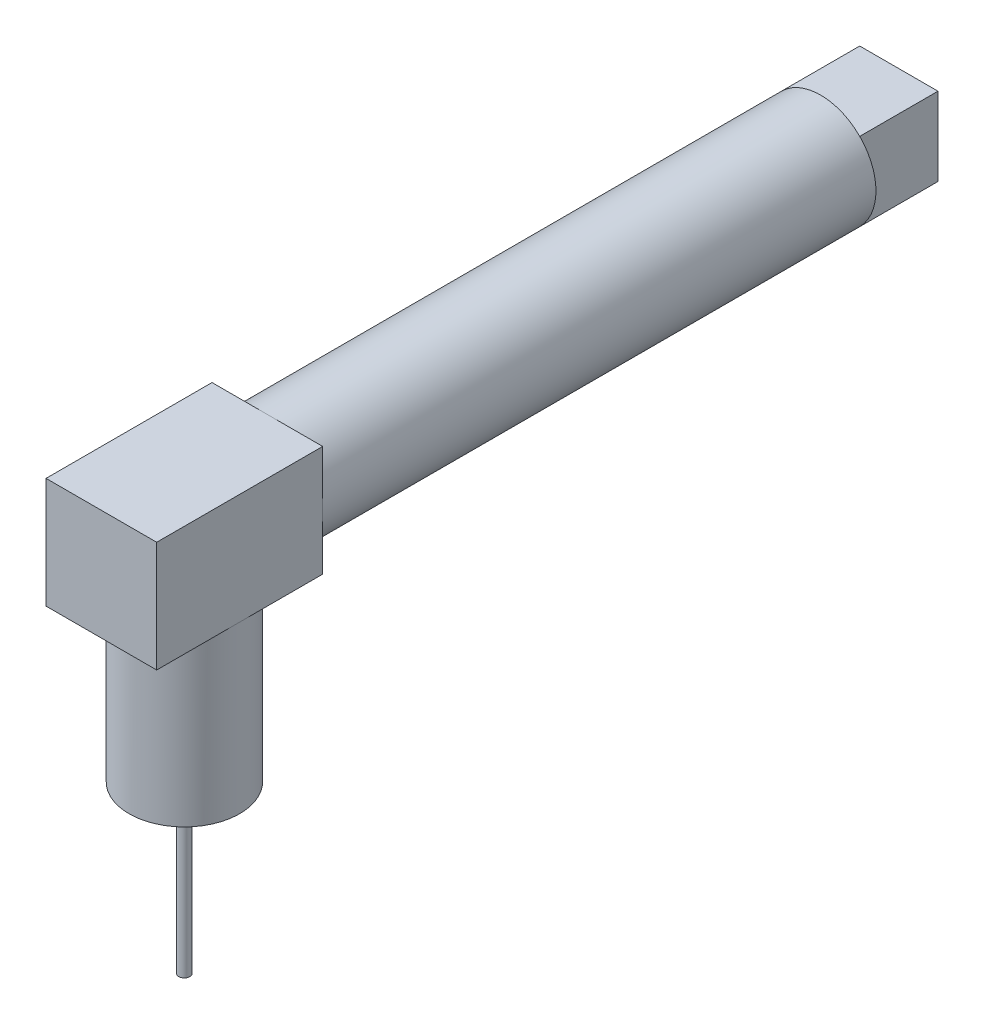
ISO-10303-21;
HEADER;
FILE_DESCRIPTION(('STEP AP214'),'2;1');
FILE_NAME('part.step','',(''),(''),'','','');
FILE_SCHEMA(('AUTOMOTIVE_DESIGN { 1 0 10303 214 1 1 1 1 }'));
ENDSEC;
DATA;
#1=APPLICATION_CONTEXT('core data for automotive mechanical design processes');
#2=APPLICATION_PROTOCOL_DEFINITION('international standard','automotive_design',2000,#1);
#3=PRODUCT_CONTEXT('',#1,'mechanical');
#4=PRODUCT('Part','Part','',(#3));
#5=PRODUCT_RELATED_PRODUCT_CATEGORY('part','',(#4));
#6=PRODUCT_DEFINITION_FORMATION('','',#4);
#7=PRODUCT_DEFINITION_CONTEXT('part definition',#1,'design');
#8=PRODUCT_DEFINITION('design','',#6,#7);
#9=PRODUCT_DEFINITION_SHAPE('','',#8);
#10=(LENGTH_UNIT() NAMED_UNIT(*) SI_UNIT(.MILLI.,.METRE.));
#11=(NAMED_UNIT(*) PLANE_ANGLE_UNIT() SI_UNIT($,.RADIAN.));
#12=(NAMED_UNIT(*) SI_UNIT($,.STERADIAN.) SOLID_ANGLE_UNIT());
#13=UNCERTAINTY_MEASURE_WITH_UNIT(LENGTH_MEASURE(1.E-05),#10,'distance_accuracy_value','');
#14=(GEOMETRIC_REPRESENTATION_CONTEXT(3) GLOBAL_UNCERTAINTY_ASSIGNED_CONTEXT((#13)) GLOBAL_UNIT_ASSIGNED_CONTEXT((#10,
#11,#12)) REPRESENTATION_CONTEXT('',''));
#15=CARTESIAN_POINT('',(0.,0.,0.));
#16=DIRECTION('',(0.,0.,1.));
#17=DIRECTION('',(1.,0.,0.));
#18=AXIS2_PLACEMENT_3D('',#15,#16,#17);
#19=CARTESIAN_POINT('',(0.,0.,0.));
#20=DIRECTION('',(0.,0.,1.));
#21=DIRECTION('',(1.,0.,0.));
#22=AXIS2_PLACEMENT_3D('',#19,#20,#21);
#23=PLANE('',#22);
#24=DIRECTION('',(0.,1.,0.));
#25=VECTOR('',#24,1.);
#26=CARTESIAN_POINT('',(-3.53553390593274,-3.53553390593274,0.));
#27=LINE('',#26,#25);
#28=CARTESIAN_POINT('',(-3.53553390593274,-3.53553390593274,0.));
#29=VERTEX_POINT('',#28);
#30=CARTESIAN_POINT('',(-3.53553390593274,3.53553390593274,0.));
#31=VERTEX_POINT('',#30);
#32=EDGE_CURVE('E65',#29,#31,#27,.T.);
#33=ORIENTED_EDGE('',*,*,#32,.F.);
#34=CARTESIAN_POINT('',(0.,0.,0.));
#35=DIRECTION('',(0.,0.,1.));
#36=DIRECTION('',(1.,0.,0.));
#37=AXIS2_PLACEMENT_3D('',#34,#35,#36);
#38=CIRCLE('',#37,5.);
#39=EDGE_CURVE('E233',#31,#29,#38,.T.);
#40=ORIENTED_EDGE('',*,*,#39,.F.);
#41=EDGE_LOOP('',(#33,#40));
#42=FACE_BOUND('',#41,.T.);
#43=ADVANCED_FACE('F43',(#42),#23,.F.);
#44=DIRECTION('',(-1.,0.,0.));
#45=VECTOR('',#44,1.);
#46=CARTESIAN_POINT('',(3.53553390593274,-3.53553390593274,0.));
#47=LINE('',#46,#45);
#48=CARTESIAN_POINT('',(3.53553390593274,-3.53553390593274,0.));
#49=VERTEX_POINT('',#48);
#50=EDGE_CURVE('E58',#49,#29,#47,.T.);
#51=ORIENTED_EDGE('',*,*,#50,.F.);
#52=EDGE_CURVE('E241',#29,#49,#38,.T.);
#53=ORIENTED_EDGE('',*,*,#52,.F.);
#54=EDGE_LOOP('',(#51,#53));
#55=FACE_BOUND('',#54,.T.);
#56=ADVANCED_FACE('F275',(#55),#23,.F.);
#57=DIRECTION('',(0.,-1.,0.));
#58=VECTOR('',#57,1.);
#59=CARTESIAN_POINT('',(3.53553390593274,-3.53553390593274,0.));
#60=LINE('',#59,#58);
#61=CARTESIAN_POINT('',(3.53553390593274,3.53553390593274,0.));
#62=VERTEX_POINT('',#61);
#63=EDGE_CURVE('E249',#62,#49,#60,.T.);
#64=ORIENTED_EDGE('',*,*,#63,.F.);
#65=EDGE_CURVE('E225',#49,#62,#38,.T.);
#66=ORIENTED_EDGE('',*,*,#65,.F.);
#67=EDGE_LOOP('',(#64,#66));
#68=FACE_BOUND('',#67,.T.);
#69=ADVANCED_FACE('F279',(#68),#23,.F.);
#70=DIRECTION('',(1.,0.,0.));
#71=VECTOR('',#70,1.);
#72=CARTESIAN_POINT('',(3.53553390593274,3.53553390593274,0.));
#73=LINE('',#72,#71);
#74=EDGE_CURVE('E254',#31,#62,#73,.T.);
#75=ORIENTED_EDGE('',*,*,#74,.F.);
#76=EDGE_CURVE('E230',#62,#31,#38,.T.);
#77=ORIENTED_EDGE('',*,*,#76,.F.);
#78=EDGE_LOOP('',(#75,#77));
#79=FACE_BOUND('',#78,.T.);
#80=ADVANCED_FACE('F273',(#79),#23,.F.);
#81=CARTESIAN_POINT('',(-5.,-5.,65.));
#82=DIRECTION('',(0.,1.,0.));
#83=DIRECTION('',(0.,0.,1.));
#84=AXIS2_PLACEMENT_3D('',#81,#82,#83);
#85=PLANE('',#84);
#86=CARTESIAN_POINT('',(0.,-5.,57.5));
#87=DIRECTION('',(0.,1.,0.));
#88=DIRECTION('',(0.,0.,1.));
#89=AXIS2_PLACEMENT_3D('',#86,#87,#88);
#90=CIRCLE('',#89,5.);
#91=CARTESIAN_POINT('',(-5.,-5.,57.5));
#92=VERTEX_POINT('',#91);
#93=CARTESIAN_POINT('',(5.,-5.,57.5));
#94=VERTEX_POINT('',#93);
#95=EDGE_CURVE('E11',#92,#94,#90,.F.);
#96=ORIENTED_EDGE('',*,*,#95,.F.);
#97=DIRECTION('',(0.,0.,-1.));
#98=VECTOR('',#97,1.);
#99=CARTESIAN_POINT('',(-5.,-5.,65.));
#100=LINE('',#99,#98);
#101=CARTESIAN_POINT('',(-5.,-5.,50.));
#102=VERTEX_POINT('',#101);
#103=EDGE_CURVE('E213',#92,#102,#100,.T.);
#104=ORIENTED_EDGE('',*,*,#103,.T.);
#105=DIRECTION('',(1.,0.,0.));
#106=VECTOR('',#105,1.);
#107=CARTESIAN_POINT('',(-5.,-5.,50.));
#108=LINE('',#107,#106);
#109=CARTESIAN_POINT('',(0.,-5.,50.));
#110=VERTEX_POINT('',#109);
#111=EDGE_CURVE('E181',#102,#110,#108,.T.);
#112=ORIENTED_EDGE('',*,*,#111,.T.);
#113=CARTESIAN_POINT('',(5.,-5.,50.));
#114=VERTEX_POINT('',#113);
#115=EDGE_CURVE('E205',#110,#114,#108,.T.);
#116=ORIENTED_EDGE('',*,*,#115,.T.);
#117=DIRECTION('',(0.,0.,-1.));
#118=VECTOR('',#117,1.);
#119=CARTESIAN_POINT('',(5.,-5.,65.));
#120=LINE('',#119,#118);
#121=EDGE_CURVE('E190',#94,#114,#120,.T.);
#122=ORIENTED_EDGE('',*,*,#121,.F.);
#123=EDGE_LOOP('',(#96,#104,#112,#116,#122));
#124=FACE_BOUND('',#123,.T.);
#125=ADVANCED_FACE('F282',(#124),#85,.F.);
#126=CARTESIAN_POINT('',(0.,0.,50.));
#127=DIRECTION('',(0.,0.,-1.));
#128=DIRECTION('',(-1.,0.,0.));
#129=AXIS2_PLACEMENT_3D('',#126,#127,#128);
#130=CYLINDRICAL_SURFACE('',#129,5.);
#131=CARTESIAN_POINT('',(0.,0.,50.));
#132=DIRECTION('',(0.,0.,1.));
#133=DIRECTION('',(1.,0.,0.));
#134=AXIS2_PLACEMENT_3D('',#131,#132,#133);
#135=CIRCLE('',#134,5.);
#136=CARTESIAN_POINT('',(5.,0.,50.));
#137=VERTEX_POINT('',#136);
#138=CARTESIAN_POINT('',(0.,5.,50.));
#139=VERTEX_POINT('',#138);
#140=EDGE_CURVE('E52',#137,#139,#135,.T.);
#141=ORIENTED_EDGE('',*,*,#140,.F.);
#142=EDGE_CURVE('E229',#110,#137,#135,.T.);
#143=ORIENTED_EDGE('',*,*,#142,.F.);
#144=CARTESIAN_POINT('',(-5.,0.,50.));
#145=VERTEX_POINT('',#144);
#146=EDGE_CURVE('E240',#145,#110,#135,.T.);
#147=ORIENTED_EDGE('',*,*,#146,.F.);
#148=EDGE_CURVE('E228',#139,#145,#135,.T.);
#149=ORIENTED_EDGE('',*,*,#148,.F.);
#150=EDGE_LOOP('',(#141,#143,#147,#149));
#151=FACE_BOUND('',#150,.T.);
#152=ORIENTED_EDGE('',*,*,#76,.T.);
#153=ORIENTED_EDGE('',*,*,#39,.T.);
#154=ORIENTED_EDGE('',*,*,#52,.T.);
#155=ORIENTED_EDGE('',*,*,#65,.T.);
#156=EDGE_LOOP('',(#152,#153,#154,#155));
#157=FACE_BOUND('',#156,.T.);
#158=ADVANCED_FACE('F45',(#151,#157),#130,.T.);
#159=CARTESIAN_POINT('',(0.,0.,50.));
#160=DIRECTION('',(0.,0.,-1.));
#161=DIRECTION('',(-1.,0.,0.));
#162=AXIS2_PLACEMENT_3D('',#159,#160,#161);
#163=PLANE('',#162);
#164=DIRECTION('',(0.,1.,0.));
#165=VECTOR('',#164,1.);
#166=CARTESIAN_POINT('',(5.,-5.,50.));
#167=LINE('',#166,#165);
#168=CARTESIAN_POINT('',(5.,5.,50.));
#169=VERTEX_POINT('',#168);
#170=EDGE_CURVE('E172',#137,#169,#167,.T.);
#171=ORIENTED_EDGE('',*,*,#170,.F.);
#172=ORIENTED_EDGE('',*,*,#140,.T.);
#173=DIRECTION('',(-1.,0.,0.));
#174=VECTOR('',#173,1.);
#175=CARTESIAN_POINT('',(-5.,5.,50.));
#176=LINE('',#175,#174);
#177=EDGE_CURVE('E196',#169,#139,#176,.T.);
#178=ORIENTED_EDGE('',*,*,#177,.F.);
#179=EDGE_LOOP('',(#171,#172,#178));
#180=FACE_BOUND('',#179,.T.);
#181=ADVANCED_FACE('F406',(#180),#163,.T.);
#182=CARTESIAN_POINT('',(-5.,5.,50.));
#183=VERTEX_POINT('',#182);
#184=EDGE_CURVE('E195',#139,#183,#176,.T.);
#185=ORIENTED_EDGE('',*,*,#184,.F.);
#186=ORIENTED_EDGE('',*,*,#148,.T.);
#187=DIRECTION('',(0.,-1.,0.));
#188=VECTOR('',#187,1.);
#189=CARTESIAN_POINT('',(-5.,-5.,50.));
#190=LINE('',#189,#188);
#191=EDGE_CURVE('E201',#183,#145,#190,.T.);
#192=ORIENTED_EDGE('',*,*,#191,.F.);
#193=EDGE_LOOP('',(#185,#186,#192));
#194=FACE_BOUND('',#193,.T.);
#195=ADVANCED_FACE('F428',(#194),#163,.T.);
#196=EDGE_CURVE('E200',#145,#102,#190,.T.);
#197=ORIENTED_EDGE('',*,*,#196,.F.);
#198=ORIENTED_EDGE('',*,*,#146,.T.);
#199=ORIENTED_EDGE('',*,*,#111,.F.);
#200=EDGE_LOOP('',(#197,#198,#199));
#201=FACE_BOUND('',#200,.T.);
#202=ADVANCED_FACE('F386',(#201),#163,.T.);
#203=CARTESIAN_POINT('',(5.,-5.,65.));
#204=DIRECTION('',(-1.,0.,0.));
#205=DIRECTION('',(0.,0.,1.));
#206=AXIS2_PLACEMENT_3D('',#203,#204,#205);
#207=PLANE('',#206);
#208=EDGE_CURVE('E191',#114,#137,#167,.T.);
#209=ORIENTED_EDGE('',*,*,#208,.T.);
#210=ORIENTED_EDGE('',*,*,#170,.T.);
#211=DIRECTION('',(0.,0.,-1.));
#212=VECTOR('',#211,1.);
#213=CARTESIAN_POINT('',(5.,5.,65.));
#214=LINE('',#213,#212);
#215=CARTESIAN_POINT('',(5.,5.,65.));
#216=VERTEX_POINT('',#215);
#217=EDGE_CURVE('E221',#216,#169,#214,.T.);
#218=ORIENTED_EDGE('',*,*,#217,.F.);
#219=DIRECTION('',(0.,1.,0.));
#220=VECTOR('',#219,1.);
#221=CARTESIAN_POINT('',(5.,-5.,65.));
#222=LINE('',#221,#220);
#223=CARTESIAN_POINT('',(5.,-5.,65.));
#224=VERTEX_POINT('',#223);
#225=EDGE_CURVE('E176',#224,#216,#222,.T.);
#226=ORIENTED_EDGE('',*,*,#225,.F.);
#227=EDGE_CURVE('E209',#224,#94,#120,.T.);
#228=ORIENTED_EDGE('',*,*,#227,.T.);
#229=ORIENTED_EDGE('',*,*,#121,.T.);
#230=EDGE_LOOP('',(#209,#210,#218,#226,#228,#229));
#231=FACE_BOUND('',#230,.T.);
#232=ADVANCED_FACE('F381',(#231),#207,.F.);
#233=CARTESIAN_POINT('',(-5.,5.,65.));
#234=DIRECTION('',(0.,-1.,0.));
#235=DIRECTION('',(0.,0.,-1.));
#236=AXIS2_PLACEMENT_3D('',#233,#234,#235);
#237=PLANE('',#236);
#238=ORIENTED_EDGE('',*,*,#177,.T.);
#239=ORIENTED_EDGE('',*,*,#184,.T.);
#240=DIRECTION('',(0.,0.,-1.));
#241=VECTOR('',#240,1.);
#242=CARTESIAN_POINT('',(-5.,5.,65.));
#243=LINE('',#242,#241);
#244=CARTESIAN_POINT('',(-5.,5.,65.));
#245=VERTEX_POINT('',#244);
#246=EDGE_CURVE('E217',#245,#183,#243,.T.);
#247=ORIENTED_EDGE('',*,*,#246,.F.);
#248=DIRECTION('',(-1.,0.,0.));
#249=VECTOR('',#248,1.);
#250=CARTESIAN_POINT('',(-5.,5.,65.));
#251=LINE('',#250,#249);
#252=EDGE_CURVE('E180',#216,#245,#251,.T.);
#253=ORIENTED_EDGE('',*,*,#252,.F.);
#254=ORIENTED_EDGE('',*,*,#217,.T.);
#255=EDGE_LOOP('',(#238,#239,#247,#253,#254));
#256=FACE_BOUND('',#255,.T.);
#257=ADVANCED_FACE('F372',(#256),#237,.F.);
#258=CARTESIAN_POINT('',(-5.,-5.,65.));
#259=DIRECTION('',(1.,0.,0.));
#260=DIRECTION('',(0.,0.,-1.));
#261=AXIS2_PLACEMENT_3D('',#258,#259,#260);
#262=PLANE('',#261);
#263=ORIENTED_EDGE('',*,*,#191,.T.);
#264=ORIENTED_EDGE('',*,*,#196,.T.);
#265=ORIENTED_EDGE('',*,*,#103,.F.);
#266=CARTESIAN_POINT('',(-5.,-5.,65.));
#267=VERTEX_POINT('',#266);
#268=EDGE_CURVE('E214',#267,#92,#100,.T.);
#269=ORIENTED_EDGE('',*,*,#268,.F.);
#270=DIRECTION('',(0.,-1.,0.));
#271=VECTOR('',#270,1.);
#272=CARTESIAN_POINT('',(-5.,-5.,65.));
#273=LINE('',#272,#271);
#274=EDGE_CURVE('E184',#245,#267,#273,.T.);
#275=ORIENTED_EDGE('',*,*,#274,.F.);
#276=ORIENTED_EDGE('',*,*,#246,.T.);
#277=EDGE_LOOP('',(#263,#264,#265,#269,#275,#276));
#278=FACE_BOUND('',#277,.T.);
#279=ADVANCED_FACE('F360',(#278),#262,.F.);
#280=CARTESIAN_POINT('',(0.,-5.,57.5));
#281=DIRECTION('',(0.,-1.,0.));
#282=DIRECTION('',(0.,0.,-1.));
#283=AXIS2_PLACEMENT_3D('',#280,#281,#282);
#284=CIRCLE('',#283,5.);
#285=EDGE_CURVE('E166',#94,#92,#284,.T.);
#286=ORIENTED_EDGE('',*,*,#285,.F.);
#287=ORIENTED_EDGE('',*,*,#227,.F.);
#288=DIRECTION('',(1.,0.,0.));
#289=VECTOR('',#288,1.);
#290=CARTESIAN_POINT('',(-5.,-5.,65.));
#291=LINE('',#290,#289);
#292=EDGE_CURVE('E187',#267,#224,#291,.T.);
#293=ORIENTED_EDGE('',*,*,#292,.F.);
#294=ORIENTED_EDGE('',*,*,#268,.T.);
#295=EDGE_LOOP('',(#286,#287,#293,#294));
#296=FACE_BOUND('',#295,.T.);
#297=ADVANCED_FACE('F289',(#296),#85,.F.);
#298=CARTESIAN_POINT('',(0.,0.,65.));
#299=DIRECTION('',(0.,0.,-1.));
#300=DIRECTION('',(-1.,0.,0.));
#301=AXIS2_PLACEMENT_3D('',#298,#299,#300);
#302=PLANE('',#301);
#303=ORIENTED_EDGE('',*,*,#225,.T.);
#304=ORIENTED_EDGE('',*,*,#252,.T.);
#305=ORIENTED_EDGE('',*,*,#274,.T.);
#306=ORIENTED_EDGE('',*,*,#292,.T.);
#307=EDGE_LOOP('',(#303,#304,#305,#306));
#308=FACE_BOUND('',#307,.T.);
#309=ADVANCED_FACE('F359',(#308),#302,.F.);
#310=ORIENTED_EDGE('',*,*,#115,.F.);
#311=ORIENTED_EDGE('',*,*,#142,.T.);
#312=ORIENTED_EDGE('',*,*,#208,.F.);
#313=EDGE_LOOP('',(#310,#311,#312));
#314=FACE_BOUND('',#313,.T.);
#315=ADVANCED_FACE('F346',(#314),#163,.T.);
#316=CARTESIAN_POINT('',(0.,-20.,57.5));
#317=DIRECTION('',(0.,1.,0.));
#318=DIRECTION('',(0.,0.,1.));
#319=AXIS2_PLACEMENT_3D('',#316,#317,#318);
#320=CYLINDRICAL_SURFACE('',#319,5.);
#321=CARTESIAN_POINT('',(0.,-20.,57.5));
#322=DIRECTION('',(0.,-1.,0.));
#323=DIRECTION('',(0.,0.,-1.));
#324=AXIS2_PLACEMENT_3D('',#321,#322,#323);
#325=CIRCLE('',#324,5.);
#326=CARTESIAN_POINT('',(0.,-20.,52.5));
#327=VERTEX_POINT('',#326);
#328=EDGE_CURVE('E168',#327,#327,#325,.T.);
#329=ORIENTED_EDGE('',*,*,#328,.F.);
#330=EDGE_LOOP('',(#329));
#331=FACE_BOUND('',#330,.T.);
#332=ORIENTED_EDGE('',*,*,#285,.T.);
#333=ORIENTED_EDGE('',*,*,#95,.T.);
#334=EDGE_LOOP('',(#332,#333));
#335=FACE_BOUND('',#334,.T.);
#336=ADVANCED_FACE('F335',(#331,#335),#320,.T.);
#337=CARTESIAN_POINT('',(0.,-20.,57.5));
#338=DIRECTION('',(0.,-1.,0.));
#339=DIRECTION('',(0.,0.,-1.));
#340=AXIS2_PLACEMENT_3D('',#337,#338,#339);
#341=PLANE('',#340);
#342=CARTESIAN_POINT('',(0.,-20.,57.5));
#343=DIRECTION('',(0.,-1.,0.));
#344=DIRECTION('',(0.,0.,-1.));
#345=AXIS2_PLACEMENT_3D('',#342,#343,#344);
#346=CIRCLE('',#345,0.5);
#347=CARTESIAN_POINT('',(0.,-20.,57.));
#348=VERTEX_POINT('',#347);
#349=EDGE_CURVE('E153',#348,#348,#346,.T.);
#350=ORIENTED_EDGE('',*,*,#349,.F.);
#351=EDGE_LOOP('',(#350));
#352=FACE_BOUND('',#351,.T.);
#353=ORIENTED_EDGE('',*,*,#328,.T.);
#354=EDGE_LOOP('',(#353));
#355=FACE_BOUND('',#354,.T.);
#356=ADVANCED_FACE('F324',(#352,#355),#341,.T.);
#357=CARTESIAN_POINT('',(0.,-35.,57.5));
#358=DIRECTION('',(0.,1.,0.));
#359=DIRECTION('',(0.,0.,1.));
#360=AXIS2_PLACEMENT_3D('',#357,#358,#359);
#361=CYLINDRICAL_SURFACE('',#360,0.5);
#362=CARTESIAN_POINT('',(0.,-35.,57.5));
#363=DIRECTION('',(0.,-1.,0.));
#364=DIRECTION('',(0.,0.,-1.));
#365=AXIS2_PLACEMENT_3D('',#362,#363,#364);
#366=CIRCLE('',#365,0.5);
#367=CARTESIAN_POINT('',(0.,-35.,57.));
#368=VERTEX_POINT('',#367);
#369=EDGE_CURVE('E158',#368,#368,#366,.T.);
#370=ORIENTED_EDGE('',*,*,#369,.F.);
#371=EDGE_LOOP('',(#370));
#372=FACE_BOUND('',#371,.T.);
#373=ORIENTED_EDGE('',*,*,#349,.T.);
#374=EDGE_LOOP('',(#373));
#375=FACE_BOUND('',#374,.T.);
#376=ADVANCED_FACE('F311',(#372,#375),#361,.T.);
#377=CARTESIAN_POINT('',(0.,-35.,57.5));
#378=DIRECTION('',(0.,-1.,0.));
#379=DIRECTION('',(0.,0.,-1.));
#380=AXIS2_PLACEMENT_3D('',#377,#378,#379);
#381=PLANE('',#380);
#382=ORIENTED_EDGE('',*,*,#369,.T.);
#383=EDGE_LOOP('',(#382));
#384=FACE_BOUND('',#383,.T.);
#385=ADVANCED_FACE('F306',(#384),#381,.T.);
#386=CARTESIAN_POINT('',(-3.53553390593274,-3.53553390593274,-7.07));
#387=DIRECTION('',(1.,0.,0.));
#388=DIRECTION('',(0.,0.,-1.));
#389=AXIS2_PLACEMENT_3D('',#386,#387,#388);
#390=PLANE('',#389);
#391=ORIENTED_EDGE('',*,*,#32,.T.);
#392=DIRECTION('',(0.,0.,1.));
#393=VECTOR('',#392,1.);
#394=CARTESIAN_POINT('',(-3.53553390593274,3.53553390593274,-7.07));
#395=LINE('',#394,#393);
#396=CARTESIAN_POINT('',(-3.53553390593274,3.53553390593274,-7.07));
#397=VERTEX_POINT('',#396);
#398=EDGE_CURVE('E133',#397,#31,#395,.T.);
#399=ORIENTED_EDGE('',*,*,#398,.F.);
#400=DIRECTION('',(0.,1.,0.));
#401=VECTOR('',#400,1.);
#402=CARTESIAN_POINT('',(-3.53553390593274,-3.53553390593274,-7.07));
#403=LINE('',#402,#401);
#404=CARTESIAN_POINT('',(-3.53553390593274,-3.53553390593274,-7.07));
#405=VERTEX_POINT('',#404);
#406=EDGE_CURVE('E140',#405,#397,#403,.T.);
#407=ORIENTED_EDGE('',*,*,#406,.F.);
#408=DIRECTION('',(0.,0.,1.));
#409=VECTOR('',#408,1.);
#410=CARTESIAN_POINT('',(-3.53553390593274,-3.53553390593274,-7.07));
#411=LINE('',#410,#409);
#412=EDGE_CURVE('E259',#405,#29,#411,.T.);
#413=ORIENTED_EDGE('',*,*,#412,.T.);
#414=EDGE_LOOP('',(#391,#399,#407,#413));
#415=FACE_BOUND('',#414,.T.);
#416=ADVANCED_FACE('F151',(#415),#390,.F.);
#417=CARTESIAN_POINT('',(3.53553390593274,3.53553390593274,-7.07));
#418=DIRECTION('',(0.,-1.,0.));
#419=DIRECTION('',(0.,0.,-1.));
#420=AXIS2_PLACEMENT_3D('',#417,#418,#419);
#421=PLANE('',#420);
#422=ORIENTED_EDGE('',*,*,#74,.T.);
#423=DIRECTION('',(0.,0.,1.));
#424=VECTOR('',#423,1.);
#425=CARTESIAN_POINT('',(3.53553390593274,3.53553390593274,-7.07));
#426=LINE('',#425,#424);
#427=CARTESIAN_POINT('',(3.53553390593274,3.53553390593274,-7.07));
#428=VERTEX_POINT('',#427);
#429=EDGE_CURVE('E135',#428,#62,#426,.T.);
#430=ORIENTED_EDGE('',*,*,#429,.F.);
#431=DIRECTION('',(1.,0.,0.));
#432=VECTOR('',#431,1.);
#433=CARTESIAN_POINT('',(3.53553390593274,3.53553390593274,-7.07));
#434=LINE('',#433,#432);
#435=EDGE_CURVE('E128',#397,#428,#434,.T.);
#436=ORIENTED_EDGE('',*,*,#435,.F.);
#437=ORIENTED_EDGE('',*,*,#398,.T.);
#438=EDGE_LOOP('',(#422,#430,#436,#437));
#439=FACE_BOUND('',#438,.T.);
#440=ADVANCED_FACE('F131',(#439),#421,.F.);
#441=CARTESIAN_POINT('',(3.53553390593274,-3.53553390593274,-7.07));
#442=DIRECTION('',(-1.,0.,0.));
#443=DIRECTION('',(0.,0.,1.));
#444=AXIS2_PLACEMENT_3D('',#441,#442,#443);
#445=PLANE('',#444);
#446=ORIENTED_EDGE('',*,*,#63,.T.);
#447=DIRECTION('',(0.,0.,1.));
#448=VECTOR('',#447,1.);
#449=CARTESIAN_POINT('',(3.53553390593274,-3.53553390593274,-7.07));
#450=LINE('',#449,#448);
#451=CARTESIAN_POINT('',(3.53553390593274,-3.53553390593274,-7.07));
#452=VERTEX_POINT('',#451);
#453=EDGE_CURVE('E160',#452,#49,#450,.T.);
#454=ORIENTED_EDGE('',*,*,#453,.F.);
#455=DIRECTION('',(0.,-1.,0.));
#456=VECTOR('',#455,1.);
#457=CARTESIAN_POINT('',(3.53553390593274,-3.53553390593274,-7.07));
#458=LINE('',#457,#456);
#459=EDGE_CURVE('E139',#428,#452,#458,.T.);
#460=ORIENTED_EDGE('',*,*,#459,.F.);
#461=ORIENTED_EDGE('',*,*,#429,.T.);
#462=EDGE_LOOP('',(#446,#454,#460,#461));
#463=FACE_BOUND('',#462,.T.);
#464=ADVANCED_FACE('F251',(#463),#445,.F.);
#465=CARTESIAN_POINT('',(3.53553390593274,-3.53553390593274,-7.07));
#466=DIRECTION('',(0.,1.,0.));
#467=DIRECTION('',(0.,0.,1.));
#468=AXIS2_PLACEMENT_3D('',#465,#466,#467);
#469=PLANE('',#468);
#470=ORIENTED_EDGE('',*,*,#50,.T.);
#471=ORIENTED_EDGE('',*,*,#412,.F.);
#472=DIRECTION('',(-1.,0.,0.));
#473=VECTOR('',#472,1.);
#474=CARTESIAN_POINT('',(3.53553390593274,-3.53553390593274,-7.07));
#475=LINE('',#474,#473);
#476=EDGE_CURVE('E145',#452,#405,#475,.T.);
#477=ORIENTED_EDGE('',*,*,#476,.F.);
#478=ORIENTED_EDGE('',*,*,#453,.T.);
#479=EDGE_LOOP('',(#470,#471,#477,#478));
#480=FACE_BOUND('',#479,.T.);
#481=ADVANCED_FACE('F257',(#480),#469,.F.);
#482=CARTESIAN_POINT('',(0.,0.,-7.07));
#483=DIRECTION('',(0.,0.,1.));
#484=DIRECTION('',(1.,0.,0.));
#485=AXIS2_PLACEMENT_3D('',#482,#483,#484);
#486=PLANE('',#485);
#487=ORIENTED_EDGE('',*,*,#406,.T.);
#488=ORIENTED_EDGE('',*,*,#435,.T.);
#489=ORIENTED_EDGE('',*,*,#459,.T.);
#490=ORIENTED_EDGE('',*,*,#476,.T.);
#491=EDGE_LOOP('',(#487,#488,#489,#490));
#492=FACE_BOUND('',#491,.T.);
#493=ADVANCED_FACE('F143',(#492),#486,.F.);
#494=CLOSED_SHELL('',(#43,#56,#69,#80,#125,#158,#181,#195,#202,#232,#257,#279,#297,#309,#315,
#336,#356,#376,#385,#416,#440,#464,#481,#493));
#495=MANIFOLD_SOLID_BREP('B2',#494);
#496=ADVANCED_BREP_SHAPE_REPRESENTATION('',(#18,#495),#14);
#497=SHAPE_DEFINITION_REPRESENTATION(#9,#496);
ENDSEC;
END-ISO-10303-21;
